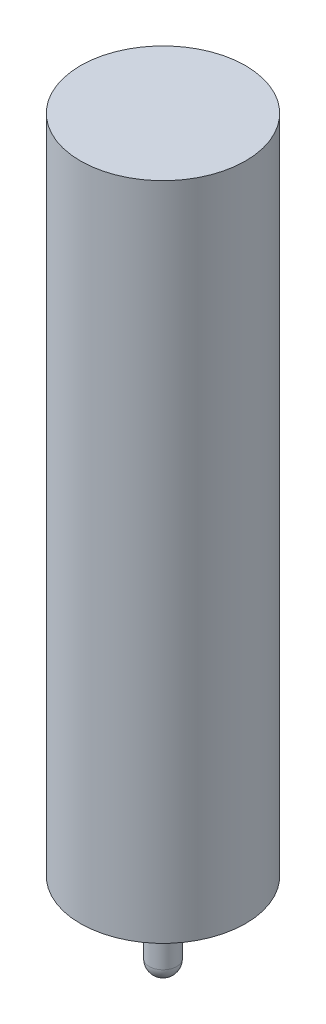
ISO-10303-21;
HEADER;
FILE_DESCRIPTION(('STEP AP214'),'2;1');
FILE_NAME('part.step','',(''),(''),'','','');
FILE_SCHEMA(('AUTOMOTIVE_DESIGN { 1 0 10303 214 1 1 1 1 }'));
ENDSEC;
DATA;
#1=APPLICATION_CONTEXT('core data for automotive mechanical design processes');
#2=APPLICATION_PROTOCOL_DEFINITION('international standard','automotive_design',2000,#1);
#3=PRODUCT_CONTEXT('',#1,'mechanical');
#4=PRODUCT('Part','Part','',(#3));
#5=PRODUCT_RELATED_PRODUCT_CATEGORY('part','',(#4));
#6=PRODUCT_DEFINITION_FORMATION('','',#4);
#7=PRODUCT_DEFINITION_CONTEXT('part definition',#1,'design');
#8=PRODUCT_DEFINITION('design','',#6,#7);
#9=PRODUCT_DEFINITION_SHAPE('','',#8);
#10=(LENGTH_UNIT() NAMED_UNIT(*) SI_UNIT(.MILLI.,.METRE.));
#11=(NAMED_UNIT(*) PLANE_ANGLE_UNIT() SI_UNIT($,.RADIAN.));
#12=(NAMED_UNIT(*) SI_UNIT($,.STERADIAN.) SOLID_ANGLE_UNIT());
#13=UNCERTAINTY_MEASURE_WITH_UNIT(LENGTH_MEASURE(1.E-05),#10,'distance_accuracy_value','');
#14=(GEOMETRIC_REPRESENTATION_CONTEXT(3) GLOBAL_UNCERTAINTY_ASSIGNED_CONTEXT((#13)) GLOBAL_UNIT_ASSIGNED_CONTEXT((#10,
#11,#12)) REPRESENTATION_CONTEXT('',''));
#15=CARTESIAN_POINT('',(0.,0.,0.));
#16=DIRECTION('',(0.,0.,1.));
#17=DIRECTION('',(1.,0.,0.));
#18=AXIS2_PLACEMENT_3D('',#15,#16,#17);
#19=CARTESIAN_POINT('',(0.,0.,0.));
#20=DIRECTION('',(0.,1.,0.));
#21=DIRECTION('',(0.,0.,1.));
#22=AXIS2_PLACEMENT_3D('',#19,#20,#21);
#23=PLANE('',#22);
#24=CARTESIAN_POINT('',(0.,0.,0.));
#25=DIRECTION('',(0.,1.,0.));
#26=DIRECTION('',(0.,0.,1.));
#27=AXIS2_PLACEMENT_3D('',#24,#25,#26);
#28=CIRCLE('',#27,0.5);
#29=CARTESIAN_POINT('',(0.,0.,0.5));
#30=VERTEX_POINT('',#29);
#31=EDGE_CURVE('E38',#30,#30,#28,.F.);
#32=ORIENTED_EDGE('',*,*,#31,.F.);
#33=EDGE_LOOP('',(#32));
#34=FACE_BOUND('',#33,.T.);
#35=CARTESIAN_POINT('',(0.,0.,0.));
#36=DIRECTION('',(0.,1.,0.));
#37=DIRECTION('',(0.,0.,1.));
#38=AXIS2_PLACEMENT_3D('',#35,#36,#37);
#39=CIRCLE('',#38,3.);
#40=CARTESIAN_POINT('',(0.,0.,3.));
#41=VERTEX_POINT('',#40);
#42=EDGE_CURVE('E42',#41,#41,#39,.F.);
#43=ORIENTED_EDGE('',*,*,#42,.T.);
#44=EDGE_LOOP('',(#43));
#45=FACE_BOUND('',#44,.T.);
#46=ADVANCED_FACE('F31',(#34,#45),#23,.F.);
#47=CARTESIAN_POINT('',(0.,-3.1,0.));
#48=DIRECTION('',(0.,1.,0.));
#49=DIRECTION('',(0.,0.,1.));
#50=AXIS2_PLACEMENT_3D('',#47,#48,#49);
#51=CYLINDRICAL_SURFACE('',#50,0.5);
#52=CARTESIAN_POINT('',(0.,-2.6,0.));
#53=DIRECTION('',(0.,1.,0.));
#54=DIRECTION('',(0.,0.,1.));
#55=AXIS2_PLACEMENT_3D('',#52,#53,#54);
#56=CIRCLE('',#55,0.5);
#57=CARTESIAN_POINT('',(0.,-2.6,0.5));
#58=VERTEX_POINT('',#57);
#59=EDGE_CURVE('E10',#58,#58,#56,.T.);
#60=ORIENTED_EDGE('',*,*,#59,.T.);
#61=EDGE_LOOP('',(#60));
#62=FACE_BOUND('',#61,.T.);
#63=ORIENTED_EDGE('',*,*,#31,.T.);
#64=EDGE_LOOP('',(#63));
#65=FACE_BOUND('',#64,.T.);
#66=ADVANCED_FACE('F64',(#62,#65),#51,.T.);
#67=CARTESIAN_POINT('',(0.,-2.6,0.));
#68=DIRECTION('',(0.,-1.,0.));
#69=DIRECTION('',(0.,0.,-1.));
#70=AXIS2_PLACEMENT_3D('',#67,#68,#69);
#71=SPHERICAL_SURFACE('',#70,0.5);
#72=ORIENTED_EDGE('',*,*,#59,.F.);
#73=EDGE_LOOP('',(#72));
#74=FACE_BOUND('',#73,.T.);
#75=ADVANCED_FACE('F33',(#74),#71,.T.);
#76=CARTESIAN_POINT('',(0.,-8.48528137423857,0.));
#77=DIRECTION('',(0.,1.,0.));
#78=DIRECTION('',(0.,0.,1.));
#79=AXIS2_PLACEMENT_3D('',#76,#77,#78);
#80=CYLINDRICAL_SURFACE('',#79,3.);
#81=ORIENTED_EDGE('',*,*,#42,.F.);
#82=EDGE_LOOP('',(#81));
#83=FACE_BOUND('',#82,.T.);
#84=CARTESIAN_POINT('',(0.,24.,0.));
#85=DIRECTION('',(0.,1.,0.));
#86=DIRECTION('',(0.,0.,1.));
#87=AXIS2_PLACEMENT_3D('',#84,#85,#86);
#88=CIRCLE('',#87,3.);
#89=CARTESIAN_POINT('',(0.,24.,3.));
#90=VERTEX_POINT('',#89);
#91=EDGE_CURVE('E46',#90,#90,#88,.T.);
#92=ORIENTED_EDGE('',*,*,#91,.F.);
#93=EDGE_LOOP('',(#92));
#94=FACE_BOUND('',#93,.T.);
#95=ADVANCED_FACE('F54',(#83,#94),#80,.T.);
#96=CARTESIAN_POINT('',(0.,24.,0.));
#97=DIRECTION('',(0.,1.,0.));
#98=DIRECTION('',(0.,0.,1.));
#99=AXIS2_PLACEMENT_3D('',#96,#97,#98);
#100=PLANE('',#99);
#101=ORIENTED_EDGE('',*,*,#91,.T.);
#102=EDGE_LOOP('',(#101));
#103=FACE_BOUND('',#102,.T.);
#104=ADVANCED_FACE('F52',(#103),#100,.T.);
#105=CLOSED_SHELL('',(#46,#66,#75,#95,#104));
#106=MANIFOLD_SOLID_BREP('B2',#105);
#107=ADVANCED_BREP_SHAPE_REPRESENTATION('',(#18,#106),#14);
#108=SHAPE_DEFINITION_REPRESENTATION(#9,#107);
ENDSEC;
END-ISO-10303-21;
